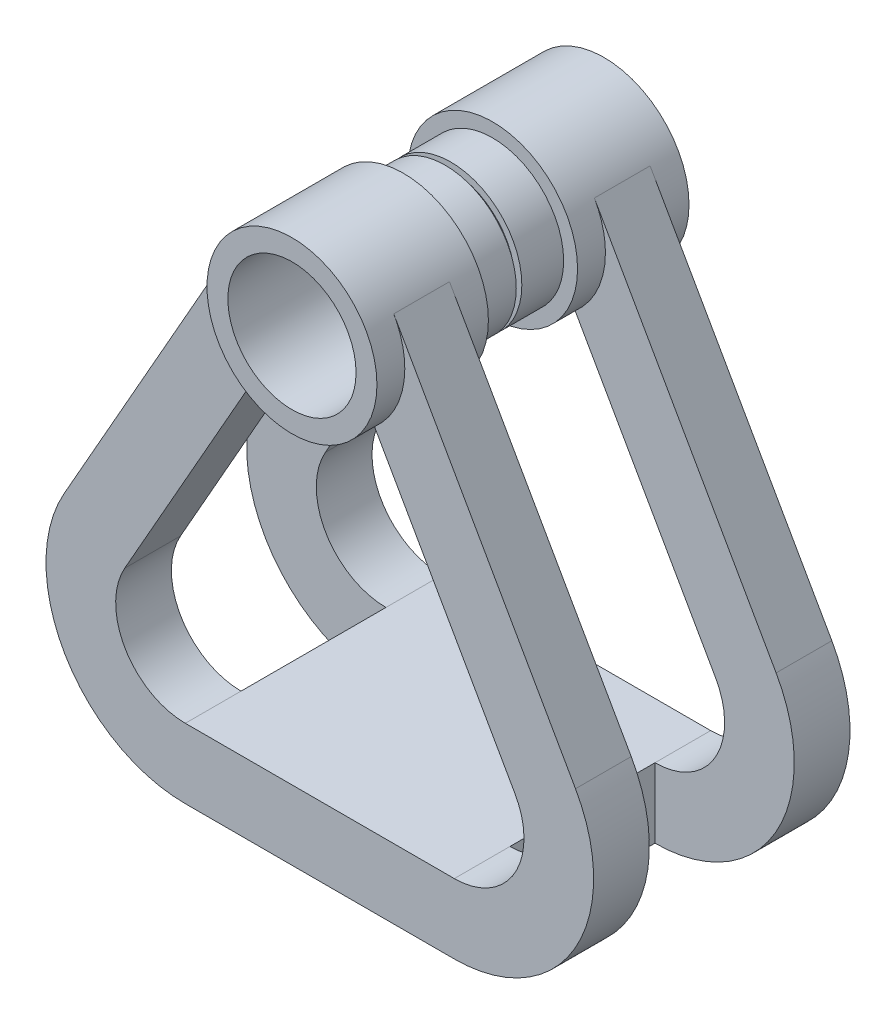
ISO-10303-21;
HEADER;
FILE_DESCRIPTION(('STEP AP214'),'2;1');
FILE_NAME('part.step','',(''),(''),'','','');
FILE_SCHEMA(('AUTOMOTIVE_DESIGN { 1 0 10303 214 1 1 1 1 }'));
ENDSEC;
DATA;
#1=APPLICATION_CONTEXT('core data for automotive mechanical design processes');
#2=APPLICATION_PROTOCOL_DEFINITION('international standard','automotive_design',2000,#1);
#3=PRODUCT_CONTEXT('',#1,'mechanical');
#4=PRODUCT('Part','Part','',(#3));
#5=PRODUCT_RELATED_PRODUCT_CATEGORY('part','',(#4));
#6=PRODUCT_DEFINITION_FORMATION('','',#4);
#7=PRODUCT_DEFINITION_CONTEXT('part definition',#1,'design');
#8=PRODUCT_DEFINITION('design','',#6,#7);
#9=PRODUCT_DEFINITION_SHAPE('','',#8);
#10=(LENGTH_UNIT() NAMED_UNIT(*) SI_UNIT(.MILLI.,.METRE.));
#11=(NAMED_UNIT(*) PLANE_ANGLE_UNIT() SI_UNIT($,.RADIAN.));
#12=(NAMED_UNIT(*) SI_UNIT($,.STERADIAN.) SOLID_ANGLE_UNIT());
#13=UNCERTAINTY_MEASURE_WITH_UNIT(LENGTH_MEASURE(1.E-05),#10,'distance_accuracy_value','');
#14=(GEOMETRIC_REPRESENTATION_CONTEXT(3) GLOBAL_UNCERTAINTY_ASSIGNED_CONTEXT((#13)) GLOBAL_UNIT_ASSIGNED_CONTEXT((#10,
#11,#12)) REPRESENTATION_CONTEXT('',''));
#15=CARTESIAN_POINT('',(0.,0.,0.));
#16=DIRECTION('',(0.,0.,1.));
#17=DIRECTION('',(1.,0.,0.));
#18=AXIS2_PLACEMENT_3D('',#15,#16,#17);
#19=CARTESIAN_POINT('',(0.,0.,5.));
#20=DIRECTION('',(0.,0.,1.));
#21=DIRECTION('',(1.,0.,0.));
#22=AXIS2_PLACEMENT_3D('',#19,#20,#21);
#23=PLANE('',#22);
#24=CARTESIAN_POINT('',(-9.65419329446629,-24.9202550824152,5.));
#25=DIRECTION('',(0.,0.,-1.));
#26=DIRECTION('',(1.,0.,0.));
#27=AXIS2_PLACEMENT_3D('',#24,#25,#26);
#28=CIRCLE('',#27,5.);
#29=CARTESIAN_POINT('',(-9.65419329446615,-29.9202550824152,5.));
#30=VERTEX_POINT('',#29);
#31=CARTESIAN_POINT('',(-14.0030577685067,-22.4529938910476,5.));
#32=VERTEX_POINT('',#31);
#33=EDGE_CURVE('E400',#30,#32,#28,.T.);
#34=ORIENTED_EDGE('',*,*,#33,.F.);
#35=DIRECTION('',(0.,1.,0.));
#36=VECTOR('',#35,1.);
#37=CARTESIAN_POINT('',(-9.65419329446615,-29.9202550824152,5.));
#38=LINE('',#37,#36);
#39=CARTESIAN_POINT('',(-9.65419329446615,-34.9202550824152,5.));
#40=VERTEX_POINT('',#39);
#41=EDGE_CURVE('E219',#40,#30,#38,.T.);
#42=ORIENTED_EDGE('',*,*,#41,.F.);
#43=CARTESIAN_POINT('',(-9.65419329446629,-24.9202550824152,5.));
#44=DIRECTION('',(0.,0.,1.));
#45=DIRECTION('',(1.,0.,0.));
#46=AXIS2_PLACEMENT_3D('',#43,#44,#45);
#47=CIRCLE('',#46,10.);
#48=CARTESIAN_POINT('',(-18.3519222425472,-19.9857326996799,5.));
#49=VERTEX_POINT('',#48);
#50=EDGE_CURVE('E414',#49,#40,#47,.T.);
#51=ORIENTED_EDGE('',*,*,#50,.F.);
#52=DIRECTION('',(-0.49345223827352,-0.869772894808095,0.));
#53=VECTOR('',#52,1.);
#54=CARTESIAN_POINT('',(-5.30561465832938,3.01005865346847,5.));
#55=LINE('',#54,#53);
#56=CARTESIAN_POINT('',(-5.30561465832938,3.01005865346847,5.));
#57=VERTEX_POINT('',#56);
#58=EDGE_CURVE('E410',#57,#49,#55,.T.);
#59=ORIENTED_EDGE('',*,*,#58,.F.);
#60=CARTESIAN_POINT('',(0.,0.,5.));
#61=DIRECTION('',(0.,0.,-1.));
#62=DIRECTION('',(1.,0.,0.));
#63=AXIS2_PLACEMENT_3D('',#60,#61,#62);
#64=CIRCLE('',#63,6.1);
#65=CARTESIAN_POINT('',(-3.91746361393002,-4.6758399067477,5.));
#66=VERTEX_POINT('',#65);
#67=EDGE_CURVE('E63',#66,#57,#64,.T.);
#68=ORIENTED_EDGE('',*,*,#67,.F.);
#69=DIRECTION('',(0.49345223827352,0.869772894808095,0.));
#70=VECTOR('',#69,1.);
#71=CARTESIAN_POINT('',(-3.91746361393002,-4.6758399067477,5.));
#72=LINE('',#71,#70);
#73=EDGE_CURVE('E404',#32,#66,#72,.T.);
#74=ORIENTED_EDGE('',*,*,#73,.F.);
#75=EDGE_LOOP('',(#34,#42,#51,#59,#68,#74));
#76=FACE_BOUND('',#75,.T.);
#77=ADVANCED_FACE('F47',(#76),#23,.F.);
#78=CARTESIAN_POINT('',(0.,0.,3.));
#79=DIRECTION('',(0.,0.,1.));
#80=DIRECTION('',(1.,0.,0.));
#81=AXIS2_PLACEMENT_3D('',#78,#79,#80);
#82=CYLINDRICAL_SURFACE('',#81,6.1);
#83=CARTESIAN_POINT('',(0.,0.,3.));
#84=DIRECTION('',(0.,0.,1.));
#85=DIRECTION('',(1.,0.,0.));
#86=AXIS2_PLACEMENT_3D('',#83,#84,#85);
#87=CIRCLE('',#86,6.1);
#88=CARTESIAN_POINT('',(6.1,0.,3.));
#89=VERTEX_POINT('',#88);
#90=EDGE_CURVE('E461',#89,#89,#87,.T.);
#91=ORIENTED_EDGE('',*,*,#90,.T.);
#92=EDGE_LOOP('',(#91));
#93=FACE_BOUND('',#92,.T.);
#94=CARTESIAN_POINT('',(0.,0.,11.));
#95=DIRECTION('',(0.,0.,1.));
#96=DIRECTION('',(1.,0.,0.));
#97=AXIS2_PLACEMENT_3D('',#94,#95,#96);
#98=CIRCLE('',#97,6.1);
#99=CARTESIAN_POINT('',(6.1,0.,11.));
#100=VERTEX_POINT('',#99);
#101=EDGE_CURVE('E430',#100,#100,#98,.T.);
#102=ORIENTED_EDGE('',*,*,#101,.F.);
#103=EDGE_LOOP('',(#102));
#104=FACE_BOUND('',#103,.T.);
#105=DIRECTION('',(0.,0.,1.));
#106=VECTOR('',#105,1.);
#107=CARTESIAN_POINT('',(5.30561465832938,3.01005865346847,5.));
#108=LINE('',#107,#106);
#109=CARTESIAN_POINT('',(5.30561465832938,3.01005865346847,5.));
#110=VERTEX_POINT('',#109);
#111=CARTESIAN_POINT('',(5.30561465832938,3.01005865346847,9.));
#112=VERTEX_POINT('',#111);
#113=EDGE_CURVE('E426',#110,#112,#108,.T.);
#114=ORIENTED_EDGE('',*,*,#113,.F.);
#115=CARTESIAN_POINT('',(0.,0.,5.));
#116=DIRECTION('',(0.,0.,-1.));
#117=DIRECTION('',(1.,0.,0.));
#118=AXIS2_PLACEMENT_3D('',#115,#116,#117);
#119=CIRCLE('',#118,6.1);
#120=CARTESIAN_POINT('',(3.91746361393003,-4.6758399067477,5.));
#121=VERTEX_POINT('',#120);
#122=EDGE_CURVE('E389',#110,#121,#119,.T.);
#123=ORIENTED_EDGE('',*,*,#122,.T.);
#124=DIRECTION('',(0.,0.,1.));
#125=VECTOR('',#124,1.);
#126=CARTESIAN_POINT('',(3.91746361393003,-4.6758399067477,5.));
#127=LINE('',#126,#125);
#128=CARTESIAN_POINT('',(3.91746361393003,-4.6758399067477,9.));
#129=VERTEX_POINT('',#128);
#130=EDGE_CURVE('E425',#121,#129,#127,.T.);
#131=ORIENTED_EDGE('',*,*,#130,.T.);
#132=CARTESIAN_POINT('',(0.,0.,9.));
#133=DIRECTION('',(0.,0.,-1.));
#134=DIRECTION('',(1.,0.,0.));
#135=AXIS2_PLACEMENT_3D('',#132,#133,#134);
#136=CIRCLE('',#135,6.1);
#137=EDGE_CURVE('E341',#112,#129,#136,.T.);
#138=ORIENTED_EDGE('',*,*,#137,.F.);
#139=EDGE_LOOP('',(#114,#123,#131,#138));
#140=FACE_BOUND('',#139,.T.);
#141=DIRECTION('',(0.,0.,1.));
#142=VECTOR('',#141,1.);
#143=CARTESIAN_POINT('',(-3.91746361393003,-4.6758399067477,5.));
#144=LINE('',#143,#142);
#145=CARTESIAN_POINT('',(-3.91746361393002,-4.6758399067477,9.));
#146=VERTEX_POINT('',#145);
#147=EDGE_CURVE('E68',#66,#146,#144,.T.);
#148=ORIENTED_EDGE('',*,*,#147,.F.);
#149=ORIENTED_EDGE('',*,*,#67,.T.);
#150=DIRECTION('',(0.,0.,1.));
#151=VECTOR('',#150,1.);
#152=CARTESIAN_POINT('',(-5.30561465832938,3.01005865346847,5.));
#153=LINE('',#152,#151);
#154=CARTESIAN_POINT('',(-5.30561465832938,3.01005865346847,9.));
#155=VERTEX_POINT('',#154);
#156=EDGE_CURVE('E442',#57,#155,#153,.T.);
#157=ORIENTED_EDGE('',*,*,#156,.T.);
#158=CARTESIAN_POINT('',(0.,0.,9.));
#159=DIRECTION('',(0.,0.,-1.));
#160=DIRECTION('',(1.,0.,0.));
#161=AXIS2_PLACEMENT_3D('',#158,#159,#160);
#162=CIRCLE('',#161,6.1);
#163=EDGE_CURVE('E365',#146,#155,#162,.T.);
#164=ORIENTED_EDGE('',*,*,#163,.F.);
#165=EDGE_LOOP('',(#148,#149,#157,#164));
#166=FACE_BOUND('',#165,.T.);
#167=ADVANCED_FACE('F501',(#93,#104,#140,#166),#82,.T.);
#168=CARTESIAN_POINT('',(0.,0.,11.));
#169=DIRECTION('',(0.,0.,-1.));
#170=DIRECTION('',(-1.,0.,0.));
#171=AXIS2_PLACEMENT_3D('',#168,#169,#170);
#172=CYLINDRICAL_SURFACE('',#171,5.1);
#173=CARTESIAN_POINT('',(0.,0.,0.));
#174=DIRECTION('',(0.,0.,1.));
#175=DIRECTION('',(1.,0.,0.));
#176=AXIS2_PLACEMENT_3D('',#173,#174,#175);
#177=CIRCLE('',#176,5.1);
#178=CARTESIAN_POINT('',(5.1,0.,0.));
#179=VERTEX_POINT('',#178);
#180=EDGE_CURVE('E56',#179,#179,#177,.T.);
#181=ORIENTED_EDGE('',*,*,#180,.T.);
#182=EDGE_LOOP('',(#181));
#183=FACE_BOUND('',#182,.T.);
#184=CARTESIAN_POINT('',(0.,0.,3.));
#185=DIRECTION('',(0.,0.,1.));
#186=DIRECTION('',(1.,0.,0.));
#187=AXIS2_PLACEMENT_3D('',#184,#185,#186);
#188=CIRCLE('',#187,5.1);
#189=CARTESIAN_POINT('',(5.1,0.,3.));
#190=VERTEX_POINT('',#189);
#191=EDGE_CURVE('E12',#190,#190,#188,.T.);
#192=ORIENTED_EDGE('',*,*,#191,.F.);
#193=EDGE_LOOP('',(#192));
#194=FACE_BOUND('',#193,.T.);
#195=ADVANCED_FACE('F49',(#183,#194),#172,.T.);
#196=CARTESIAN_POINT('',(0.,0.,11.));
#197=DIRECTION('',(0.,0.,1.));
#198=DIRECTION('',(1.,0.,0.));
#199=AXIS2_PLACEMENT_3D('',#196,#197,#198);
#200=PLANE('',#199);
#201=CARTESIAN_POINT('',(0.,0.,11.));
#202=DIRECTION('',(0.,0.,1.));
#203=DIRECTION('',(1.,0.,0.));
#204=AXIS2_PLACEMENT_3D('',#201,#202,#203);
#205=CIRCLE('',#204,4.6);
#206=CARTESIAN_POINT('',(4.6,0.,11.));
#207=VERTEX_POINT('',#206);
#208=EDGE_CURVE('E469',#207,#207,#205,.T.);
#209=ORIENTED_EDGE('',*,*,#208,.F.);
#210=EDGE_LOOP('',(#209));
#211=FACE_BOUND('',#210,.T.);
#212=ORIENTED_EDGE('',*,*,#101,.T.);
#213=EDGE_LOOP('',(#212));
#214=FACE_BOUND('',#213,.T.);
#215=ADVANCED_FACE('F485',(#211,#214),#200,.T.);
#216=CARTESIAN_POINT('',(0.,0.,0.));
#217=DIRECTION('',(0.,0.,1.));
#218=DIRECTION('',(1.,0.,0.));
#219=AXIS2_PLACEMENT_3D('',#216,#217,#218);
#220=PLANE('',#219);
#221=ORIENTED_EDGE('',*,*,#180,.F.);
#222=EDGE_LOOP('',(#221));
#223=FACE_BOUND('',#222,.T.);
#224=CARTESIAN_POINT('',(0.,0.,0.));
#225=DIRECTION('',(0.,0.,1.));
#226=DIRECTION('',(1.,0.,0.));
#227=AXIS2_PLACEMENT_3D('',#224,#225,#226);
#228=CIRCLE('',#227,4.6);
#229=CARTESIAN_POINT('',(4.6,0.,0.));
#230=VERTEX_POINT('',#229);
#231=EDGE_CURVE('E465',#230,#230,#228,.T.);
#232=ORIENTED_EDGE('',*,*,#231,.T.);
#233=EDGE_LOOP('',(#232));
#234=FACE_BOUND('',#233,.T.);
#235=ADVANCED_FACE('F481',(#223,#234),#220,.F.);
#236=CARTESIAN_POINT('',(0.,0.,11.));
#237=DIRECTION('',(0.,0.,-1.));
#238=DIRECTION('',(-1.,0.,0.));
#239=AXIS2_PLACEMENT_3D('',#236,#237,#238);
#240=CYLINDRICAL_SURFACE('',#239,4.6);
#241=ORIENTED_EDGE('',*,*,#208,.T.);
#242=EDGE_LOOP('',(#241));
#243=FACE_BOUND('',#242,.T.);
#244=ORIENTED_EDGE('',*,*,#231,.F.);
#245=EDGE_LOOP('',(#244));
#246=FACE_BOUND('',#245,.T.);
#247=ADVANCED_FACE('F484',(#243,#246),#240,.F.);
#248=CARTESIAN_POINT('',(0.,0.,3.));
#249=DIRECTION('',(0.,0.,1.));
#250=DIRECTION('',(1.,0.,0.));
#251=AXIS2_PLACEMENT_3D('',#248,#249,#250);
#252=PLANE('',#251);
#253=ORIENTED_EDGE('',*,*,#191,.T.);
#254=EDGE_LOOP('',(#253));
#255=FACE_BOUND('',#254,.T.);
#256=ORIENTED_EDGE('',*,*,#90,.F.);
#257=EDGE_LOOP('',(#256));
#258=FACE_BOUND('',#257,.T.);
#259=ADVANCED_FACE('F489',(#255,#258),#252,.F.);
#260=CARTESIAN_POINT('',(5.30561465832938,3.01005865346847,5.));
#261=DIRECTION('',(0.869772894808095,0.49345223827352,0.));
#262=DIRECTION('',(-0.49345223827352,0.869772894808095,0.));
#263=AXIS2_PLACEMENT_3D('',#260,#261,#262);
#264=PLANE('',#263);
#265=ORIENTED_EDGE('',*,*,#113,.T.);
#266=DIRECTION('',(-0.49345223827352,0.869772894808095,0.));
#267=VECTOR('',#266,1.);
#268=CARTESIAN_POINT('',(5.30561465832938,3.01005865346847,9.));
#269=LINE('',#268,#267);
#270=CARTESIAN_POINT('',(18.3519222425472,-19.9857326996799,9.));
#271=VERTEX_POINT('',#270);
#272=EDGE_CURVE('E385',#271,#112,#269,.T.);
#273=ORIENTED_EDGE('',*,*,#272,.F.);
#274=DIRECTION('',(0.,0.,1.));
#275=VECTOR('',#274,1.);
#276=CARTESIAN_POINT('',(18.3519222425472,-19.9857326996799,5.));
#277=LINE('',#276,#275);
#278=CARTESIAN_POINT('',(18.3519222425472,-19.9857326996799,5.));
#279=VERTEX_POINT('',#278);
#280=EDGE_CURVE('E431',#279,#271,#277,.T.);
#281=ORIENTED_EDGE('',*,*,#280,.F.);
#282=DIRECTION('',(-0.49345223827352,0.869772894808095,0.));
#283=VECTOR('',#282,1.);
#284=CARTESIAN_POINT('',(5.30561465832938,3.01005865346847,5.));
#285=LINE('',#284,#283);
#286=EDGE_CURVE('E421',#279,#110,#285,.T.);
#287=ORIENTED_EDGE('',*,*,#286,.T.);
#288=EDGE_LOOP('',(#265,#273,#281,#287));
#289=FACE_BOUND('',#288,.T.);
#290=ADVANCED_FACE('F495',(#289),#264,.T.);
#291=CARTESIAN_POINT('',(9.6541932944663,-24.9202550824152,5.));
#292=DIRECTION('',(0.,0.,1.));
#293=DIRECTION('',(1.,0.,0.));
#294=AXIS2_PLACEMENT_3D('',#291,#292,#293);
#295=CYLINDRICAL_SURFACE('',#294,10.);
#296=ORIENTED_EDGE('',*,*,#280,.T.);
#297=CARTESIAN_POINT('',(9.6541932944663,-24.9202550824152,9.));
#298=DIRECTION('',(0.,0.,1.));
#299=DIRECTION('',(-1.,0.,0.));
#300=AXIS2_PLACEMENT_3D('',#297,#298,#299);
#301=CIRCLE('',#300,10.);
#302=CARTESIAN_POINT('',(9.65419329446616,-34.9202550824152,9.));
#303=VERTEX_POINT('',#302);
#304=EDGE_CURVE('E381',#303,#271,#301,.T.);
#305=ORIENTED_EDGE('',*,*,#304,.F.);
#306=DIRECTION('',(0.,0.,1.));
#307=VECTOR('',#306,1.);
#308=CARTESIAN_POINT('',(9.65419329446616,-34.9202550824152,5.));
#309=LINE('',#308,#307);
#310=CARTESIAN_POINT('',(9.65419329446623,-34.9202550824152,5.));
#311=VERTEX_POINT('',#310);
#312=EDGE_CURVE('E434',#311,#303,#309,.T.);
#313=ORIENTED_EDGE('',*,*,#312,.F.);
#314=CARTESIAN_POINT('',(9.6541932944663,-24.9202550824152,5.));
#315=DIRECTION('',(0.,0.,1.));
#316=DIRECTION('',(-1.,0.,0.));
#317=AXIS2_PLACEMENT_3D('',#314,#315,#316);
#318=CIRCLE('',#317,10.);
#319=EDGE_CURVE('E417',#311,#279,#318,.T.);
#320=ORIENTED_EDGE('',*,*,#319,.T.);
#321=EDGE_LOOP('',(#296,#305,#313,#320));
#322=FACE_BOUND('',#321,.T.);
#323=ADVANCED_FACE('F532',(#322),#295,.T.);
#324=CARTESIAN_POINT('',(9.65419329446616,-34.9202550824152,5.));
#325=DIRECTION('',(0.,-1.,0.));
#326=DIRECTION('',(0.,0.,-1.));
#327=AXIS2_PLACEMENT_3D('',#324,#325,#326);
#328=PLANE('',#327);
#329=ORIENTED_EDGE('',*,*,#312,.T.);
#330=DIRECTION('',(1.,0.,0.));
#331=VECTOR('',#330,1.);
#332=CARTESIAN_POINT('',(9.65419329446616,-34.9202550824152,9.));
#333=LINE('',#332,#331);
#334=CARTESIAN_POINT('',(-9.65419329446615,-34.9202550824152,9.));
#335=VERTEX_POINT('',#334);
#336=EDGE_CURVE('E377',#335,#303,#333,.T.);
#337=ORIENTED_EDGE('',*,*,#336,.F.);
#338=DIRECTION('',(0.,0.,1.));
#339=VECTOR('',#338,1.);
#340=CARTESIAN_POINT('',(-9.65419329446615,-34.9202550824152,5.));
#341=LINE('',#340,#339);
#342=EDGE_CURVE('E212',#40,#335,#341,.T.);
#343=ORIENTED_EDGE('',*,*,#342,.F.);
#344=DIRECTION('',(0.,0.,-1.));
#345=VECTOR('',#344,1.);
#346=CARTESIAN_POINT('',(-9.65419329446615,-34.9202550824152,24.9452699321835));
#347=LINE('',#346,#345);
#348=CARTESIAN_POINT('',(-9.65419329446615,-34.9202550824152,-5.4));
#349=VERTEX_POINT('',#348);
#350=EDGE_CURVE('E207',#40,#349,#347,.T.);
#351=ORIENTED_EDGE('',*,*,#350,.T.);
#352=DIRECTION('',(0.,0.,-1.));
#353=VECTOR('',#352,1.);
#354=CARTESIAN_POINT('',(-9.65419329446615,-34.9202550824152,-5.4));
#355=LINE('',#354,#353);
#356=CARTESIAN_POINT('',(-9.65419329446615,-34.9202550824152,-9.4));
#357=VERTEX_POINT('',#356);
#358=EDGE_CURVE('E210',#349,#357,#355,.T.);
#359=ORIENTED_EDGE('',*,*,#358,.T.);
#360=DIRECTION('',(1.,0.,0.));
#361=VECTOR('',#360,1.);
#362=CARTESIAN_POINT('',(9.65419329446616,-34.9202550824152,-9.4));
#363=LINE('',#362,#361);
#364=CARTESIAN_POINT('',(9.65419329446616,-34.9202550824152,-9.4));
#365=VERTEX_POINT('',#364);
#366=EDGE_CURVE('E611',#357,#365,#363,.T.);
#367=ORIENTED_EDGE('',*,*,#366,.T.);
#368=DIRECTION('',(0.,0.,-1.));
#369=VECTOR('',#368,1.);
#370=CARTESIAN_POINT('',(9.65419329446616,-34.9202550824152,-5.4));
#371=LINE('',#370,#369);
#372=CARTESIAN_POINT('',(9.65419329446623,-34.9202550824152,-5.4));
#373=VERTEX_POINT('',#372);
#374=EDGE_CURVE('E233',#373,#365,#371,.T.);
#375=ORIENTED_EDGE('',*,*,#374,.F.);
#376=DIRECTION('',(0.,0.,-1.));
#377=VECTOR('',#376,1.);
#378=CARTESIAN_POINT('',(9.65419329446623,-34.9202550824152,24.9452699321835));
#379=LINE('',#378,#377);
#380=EDGE_CURVE('E331',#311,#373,#379,.T.);
#381=ORIENTED_EDGE('',*,*,#380,.F.);
#382=EDGE_LOOP('',(#329,#337,#343,#351,#359,#367,#375,#381));
#383=FACE_BOUND('',#382,.T.);
#384=ADVANCED_FACE('F209',(#383),#328,.T.);
#385=CARTESIAN_POINT('',(-9.65419329446629,-24.9202550824152,5.));
#386=DIRECTION('',(0.,0.,1.));
#387=DIRECTION('',(1.,0.,0.));
#388=AXIS2_PLACEMENT_3D('',#385,#386,#387);
#389=CYLINDRICAL_SURFACE('',#388,10.);
#390=ORIENTED_EDGE('',*,*,#342,.T.);
#391=CARTESIAN_POINT('',(-9.65419329446629,-24.9202550824152,9.));
#392=DIRECTION('',(0.,0.,1.));
#393=DIRECTION('',(1.,0.,0.));
#394=AXIS2_PLACEMENT_3D('',#391,#392,#393);
#395=CIRCLE('',#394,10.);
#396=CARTESIAN_POINT('',(-18.3519222425472,-19.9857326996799,9.));
#397=VERTEX_POINT('',#396);
#398=EDGE_CURVE('E373',#397,#335,#395,.T.);
#399=ORIENTED_EDGE('',*,*,#398,.F.);
#400=DIRECTION('',(0.,0.,1.));
#401=VECTOR('',#400,1.);
#402=CARTESIAN_POINT('',(-18.3519222425472,-19.9857326996799,5.));
#403=LINE('',#402,#401);
#404=EDGE_CURVE('E439',#49,#397,#403,.T.);
#405=ORIENTED_EDGE('',*,*,#404,.F.);
#406=ORIENTED_EDGE('',*,*,#50,.T.);
#407=EDGE_LOOP('',(#390,#399,#405,#406));
#408=FACE_BOUND('',#407,.T.);
#409=ADVANCED_FACE('F540',(#408),#389,.T.);
#410=CARTESIAN_POINT('',(-5.30561465832938,3.01005865346847,5.));
#411=DIRECTION('',(-0.869772894808095,0.49345223827352,0.));
#412=DIRECTION('',(-0.49345223827352,-0.869772894808095,0.));
#413=AXIS2_PLACEMENT_3D('',#410,#411,#412);
#414=PLANE('',#413);
#415=ORIENTED_EDGE('',*,*,#404,.T.);
#416=DIRECTION('',(-0.49345223827352,-0.869772894808095,0.));
#417=VECTOR('',#416,1.);
#418=CARTESIAN_POINT('',(-5.30561465832938,3.01005865346847,9.));
#419=LINE('',#418,#417);
#420=EDGE_CURVE('E369',#155,#397,#419,.T.);
#421=ORIENTED_EDGE('',*,*,#420,.F.);
#422=ORIENTED_EDGE('',*,*,#156,.F.);
#423=ORIENTED_EDGE('',*,*,#58,.T.);
#424=EDGE_LOOP('',(#415,#421,#422,#423));
#425=FACE_BOUND('',#424,.T.);
#426=ADVANCED_FACE('F544',(#425),#414,.T.);
#427=CARTESIAN_POINT('',(-3.91746361393002,-4.6758399067477,5.));
#428=DIRECTION('',(0.869772894808095,-0.49345223827352,0.));
#429=DIRECTION('',(0.49345223827352,0.869772894808095,0.));
#430=AXIS2_PLACEMENT_3D('',#427,#428,#429);
#431=PLANE('',#430);
#432=ORIENTED_EDGE('',*,*,#147,.T.);
#433=DIRECTION('',(0.49345223827352,0.869772894808095,0.));
#434=VECTOR('',#433,1.);
#435=CARTESIAN_POINT('',(-3.91746361393002,-4.6758399067477,9.));
#436=LINE('',#435,#434);
#437=CARTESIAN_POINT('',(-14.0030577685067,-22.4529938910476,9.));
#438=VERTEX_POINT('',#437);
#439=EDGE_CURVE('E361',#438,#146,#436,.T.);
#440=ORIENTED_EDGE('',*,*,#439,.F.);
#441=DIRECTION('',(0.,0.,1.));
#442=VECTOR('',#441,1.);
#443=CARTESIAN_POINT('',(-14.0030577685067,-22.4529938910476,5.));
#444=LINE('',#443,#442);
#445=EDGE_CURVE('E447',#32,#438,#444,.T.);
#446=ORIENTED_EDGE('',*,*,#445,.F.);
#447=ORIENTED_EDGE('',*,*,#73,.T.);
#448=EDGE_LOOP('',(#432,#440,#446,#447));
#449=FACE_BOUND('',#448,.T.);
#450=ADVANCED_FACE('F548',(#449),#431,.T.);
#451=CARTESIAN_POINT('',(-9.65419329446629,-24.9202550824152,5.));
#452=DIRECTION('',(0.,0.,1.));
#453=DIRECTION('',(1.,0.,0.));
#454=AXIS2_PLACEMENT_3D('',#451,#452,#453);
#455=CYLINDRICAL_SURFACE('',#454,5.);
#456=ORIENTED_EDGE('',*,*,#445,.T.);
#457=CARTESIAN_POINT('',(-9.65419329446629,-24.9202550824152,9.));
#458=DIRECTION('',(0.,0.,-1.));
#459=DIRECTION('',(1.,0.,0.));
#460=AXIS2_PLACEMENT_3D('',#457,#458,#459);
#461=CIRCLE('',#460,5.);
#462=CARTESIAN_POINT('',(-9.65419329446615,-29.9202550824152,9.));
#463=VERTEX_POINT('',#462);
#464=EDGE_CURVE('E357',#463,#438,#461,.T.);
#465=ORIENTED_EDGE('',*,*,#464,.F.);
#466=DIRECTION('',(0.,0.,1.));
#467=VECTOR('',#466,1.);
#468=CARTESIAN_POINT('',(-9.65419329446615,-29.9202550824152,5.));
#469=LINE('',#468,#467);
#470=EDGE_CURVE('E450',#30,#463,#469,.T.);
#471=ORIENTED_EDGE('',*,*,#470,.F.);
#472=ORIENTED_EDGE('',*,*,#33,.T.);
#473=EDGE_LOOP('',(#456,#465,#471,#472));
#474=FACE_BOUND('',#473,.T.);
#475=ADVANCED_FACE('F552',(#474),#455,.F.);
#476=CARTESIAN_POINT('',(9.65419329446623,-29.9202550824152,5.));
#477=DIRECTION('',(0.,1.,0.));
#478=DIRECTION('',(0.,0.,1.));
#479=AXIS2_PLACEMENT_3D('',#476,#477,#478);
#480=PLANE('',#479);
#481=ORIENTED_EDGE('',*,*,#470,.T.);
#482=DIRECTION('',(-1.,0.,0.));
#483=VECTOR('',#482,1.);
#484=CARTESIAN_POINT('',(9.65419329446623,-29.9202550824152,9.));
#485=LINE('',#484,#483);
#486=CARTESIAN_POINT('',(9.65419329446623,-29.9202550824152,9.));
#487=VERTEX_POINT('',#486);
#488=EDGE_CURVE('E353',#487,#463,#485,.T.);
#489=ORIENTED_EDGE('',*,*,#488,.F.);
#490=DIRECTION('',(0.,0.,1.));
#491=VECTOR('',#490,1.);
#492=CARTESIAN_POINT('',(9.65419329446623,-29.9202550824152,5.));
#493=LINE('',#492,#491);
#494=CARTESIAN_POINT('',(9.65419329446623,-29.9202550824152,5.));
#495=VERTEX_POINT('',#494);
#496=EDGE_CURVE('E453',#495,#487,#493,.T.);
#497=ORIENTED_EDGE('',*,*,#496,.F.);
#498=DIRECTION('',(0.,0.,-1.));
#499=VECTOR('',#498,1.);
#500=CARTESIAN_POINT('',(9.65419329446623,-29.9202550824152,24.9452699321835));
#501=LINE('',#500,#499);
#502=CARTESIAN_POINT('',(9.65419329446623,-29.9202550824152,-5.4));
#503=VERTEX_POINT('',#502);
#504=EDGE_CURVE('E332',#495,#503,#501,.T.);
#505=ORIENTED_EDGE('',*,*,#504,.T.);
#506=DIRECTION('',(0.,0.,-1.));
#507=VECTOR('',#506,1.);
#508=CARTESIAN_POINT('',(9.65419329446623,-29.9202550824152,-5.4));
#509=LINE('',#508,#507);
#510=CARTESIAN_POINT('',(9.65419329446623,-29.9202550824152,-9.4));
#511=VERTEX_POINT('',#510);
#512=EDGE_CURVE('E295',#503,#511,#509,.T.);
#513=ORIENTED_EDGE('',*,*,#512,.T.);
#514=DIRECTION('',(-1.,0.,0.));
#515=VECTOR('',#514,1.);
#516=CARTESIAN_POINT('',(9.65419329446623,-29.9202550824152,-9.4));
#517=LINE('',#516,#515);
#518=CARTESIAN_POINT('',(-9.65419329446615,-29.9202550824152,-9.4));
#519=VERTEX_POINT('',#518);
#520=EDGE_CURVE('E585',#511,#519,#517,.T.);
#521=ORIENTED_EDGE('',*,*,#520,.T.);
#522=DIRECTION('',(0.,0.,-1.));
#523=VECTOR('',#522,1.);
#524=CARTESIAN_POINT('',(-9.65419329446615,-29.9202550824152,-5.4));
#525=LINE('',#524,#523);
#526=CARTESIAN_POINT('',(-9.65419329446615,-29.9202550824152,-5.4));
#527=VERTEX_POINT('',#526);
#528=EDGE_CURVE('E291',#527,#519,#525,.T.);
#529=ORIENTED_EDGE('',*,*,#528,.F.);
#530=DIRECTION('',(0.,0.,-1.));
#531=VECTOR('',#530,1.);
#532=CARTESIAN_POINT('',(-9.65419329446615,-29.9202550824152,24.9452699321835));
#533=LINE('',#532,#531);
#534=EDGE_CURVE('E239',#30,#527,#533,.T.);
#535=ORIENTED_EDGE('',*,*,#534,.F.);
#536=EDGE_LOOP('',(#481,#489,#497,#505,#513,#521,#529,#535));
#537=FACE_BOUND('',#536,.T.);
#538=ADVANCED_FACE('F555',(#537),#480,.T.);
#539=CARTESIAN_POINT('',(9.6541932944663,-24.9202550824152,5.));
#540=DIRECTION('',(0.,0.,1.));
#541=DIRECTION('',(1.,0.,0.));
#542=AXIS2_PLACEMENT_3D('',#539,#540,#541);
#543=CYLINDRICAL_SURFACE('',#542,5.);
#544=ORIENTED_EDGE('',*,*,#496,.T.);
#545=CARTESIAN_POINT('',(9.6541932944663,-24.9202550824152,9.));
#546=DIRECTION('',(0.,0.,-1.));
#547=DIRECTION('',(-1.,0.,0.));
#548=AXIS2_PLACEMENT_3D('',#545,#546,#547);
#549=CIRCLE('',#548,5.);
#550=CARTESIAN_POINT('',(14.0030577685067,-22.4529938910475,9.));
#551=VERTEX_POINT('',#550);
#552=EDGE_CURVE('E349',#551,#487,#549,.T.);
#553=ORIENTED_EDGE('',*,*,#552,.F.);
#554=DIRECTION('',(0.,0.,1.));
#555=VECTOR('',#554,1.);
#556=CARTESIAN_POINT('',(14.0030577685067,-22.4529938910475,5.));
#557=LINE('',#556,#555);
#558=CARTESIAN_POINT('',(14.0030577685067,-22.4529938910475,5.));
#559=VERTEX_POINT('',#558);
#560=EDGE_CURVE('E456',#559,#551,#557,.T.);
#561=ORIENTED_EDGE('',*,*,#560,.F.);
#562=CARTESIAN_POINT('',(9.6541932944663,-24.9202550824152,5.));
#563=DIRECTION('',(0.,0.,-1.));
#564=DIRECTION('',(-1.,0.,0.));
#565=AXIS2_PLACEMENT_3D('',#562,#563,#564);
#566=CIRCLE('',#565,5.);
#567=EDGE_CURVE('E396',#559,#495,#566,.T.);
#568=ORIENTED_EDGE('',*,*,#567,.T.);
#569=EDGE_LOOP('',(#544,#553,#561,#568));
#570=FACE_BOUND('',#569,.T.);
#571=ADVANCED_FACE('F521',(#570),#543,.F.);
#572=CARTESIAN_POINT('',(3.91746361393003,-4.6758399067477,5.));
#573=DIRECTION('',(-0.869772894808095,-0.49345223827352,0.));
#574=DIRECTION('',(0.49345223827352,-0.869772894808095,0.));
#575=AXIS2_PLACEMENT_3D('',#572,#573,#574);
#576=PLANE('',#575);
#577=ORIENTED_EDGE('',*,*,#560,.T.);
#578=DIRECTION('',(0.49345223827352,-0.869772894808095,0.));
#579=VECTOR('',#578,1.);
#580=CARTESIAN_POINT('',(3.91746361393003,-4.6758399067477,9.));
#581=LINE('',#580,#579);
#582=EDGE_CURVE('E345',#129,#551,#581,.T.);
#583=ORIENTED_EDGE('',*,*,#582,.F.);
#584=ORIENTED_EDGE('',*,*,#130,.F.);
#585=DIRECTION('',(0.49345223827352,-0.869772894808095,0.));
#586=VECTOR('',#585,1.);
#587=CARTESIAN_POINT('',(3.91746361393003,-4.6758399067477,5.));
#588=LINE('',#587,#586);
#589=EDGE_CURVE('E392',#121,#559,#588,.T.);
#590=ORIENTED_EDGE('',*,*,#589,.T.);
#591=EDGE_LOOP('',(#577,#583,#584,#590));
#592=FACE_BOUND('',#591,.T.);
#593=ADVANCED_FACE('F514',(#592),#576,.T.);
#594=ORIENTED_EDGE('',*,*,#319,.F.);
#595=DIRECTION('',(0.,-1.,0.));
#596=VECTOR('',#595,1.);
#597=CARTESIAN_POINT('',(9.65419329446623,-29.9202550824152,5.));
#598=LINE('',#597,#596);
#599=EDGE_CURVE('E328',#495,#311,#598,.T.);
#600=ORIENTED_EDGE('',*,*,#599,.F.);
#601=ORIENTED_EDGE('',*,*,#567,.F.);
#602=ORIENTED_EDGE('',*,*,#589,.F.);
#603=ORIENTED_EDGE('',*,*,#122,.F.);
#604=ORIENTED_EDGE('',*,*,#286,.F.);
#605=EDGE_LOOP('',(#594,#600,#601,#602,#603,#604));
#606=FACE_BOUND('',#605,.T.);
#607=ADVANCED_FACE('F504',(#606),#23,.F.);
#608=CARTESIAN_POINT('',(0.,0.,9.));
#609=DIRECTION('',(0.,0.,1.));
#610=DIRECTION('',(1.,0.,0.));
#611=AXIS2_PLACEMENT_3D('',#608,#609,#610);
#612=PLANE('',#611);
#613=ORIENTED_EDGE('',*,*,#137,.T.);
#614=ORIENTED_EDGE('',*,*,#582,.T.);
#615=ORIENTED_EDGE('',*,*,#552,.T.);
#616=ORIENTED_EDGE('',*,*,#488,.T.);
#617=ORIENTED_EDGE('',*,*,#464,.T.);
#618=ORIENTED_EDGE('',*,*,#439,.T.);
#619=ORIENTED_EDGE('',*,*,#163,.T.);
#620=ORIENTED_EDGE('',*,*,#420,.T.);
#621=ORIENTED_EDGE('',*,*,#398,.T.);
#622=ORIENTED_EDGE('',*,*,#336,.T.);
#623=ORIENTED_EDGE('',*,*,#304,.T.);
#624=ORIENTED_EDGE('',*,*,#272,.T.);
#625=EDGE_LOOP('',(#613,#614,#615,#616,#617,#618,#619,#620,#621,#622,#623,#624));
#626=FACE_BOUND('',#625,.T.);
#627=ADVANCED_FACE('F513',(#626),#612,.T.);
#628=CARTESIAN_POINT('',(-9.65419329446615,-29.9202550824152,24.9452699321835));
#629=DIRECTION('',(-1.,0.,0.));
#630=DIRECTION('',(0.,0.,1.));
#631=AXIS2_PLACEMENT_3D('',#628,#629,#630);
#632=PLANE('',#631);
#633=ORIENTED_EDGE('',*,*,#350,.F.);
#634=ORIENTED_EDGE('',*,*,#41,.T.);
#635=ORIENTED_EDGE('',*,*,#534,.T.);
#636=DIRECTION('',(0.,1.,0.));
#637=VECTOR('',#636,1.);
#638=CARTESIAN_POINT('',(-9.65419329446615,-29.9202550824152,-5.4));
#639=LINE('',#638,#637);
#640=EDGE_CURVE('E237',#349,#527,#639,.T.);
#641=ORIENTED_EDGE('',*,*,#640,.F.);
#642=EDGE_LOOP('',(#633,#634,#635,#641));
#643=FACE_BOUND('',#642,.T.);
#644=ADVANCED_FACE('F238',(#643),#632,.T.);
#645=CARTESIAN_POINT('',(9.65419329446623,-29.9202550824152,24.9452699321835));
#646=DIRECTION('',(1.,0.,0.));
#647=DIRECTION('',(0.,0.,-1.));
#648=AXIS2_PLACEMENT_3D('',#645,#646,#647);
#649=PLANE('',#648);
#650=ORIENTED_EDGE('',*,*,#504,.F.);
#651=ORIENTED_EDGE('',*,*,#599,.T.);
#652=ORIENTED_EDGE('',*,*,#380,.T.);
#653=DIRECTION('',(0.,-1.,0.));
#654=VECTOR('',#653,1.);
#655=CARTESIAN_POINT('',(9.65419329446623,-29.9202550824152,-5.4));
#656=LINE('',#655,#654);
#657=EDGE_CURVE('E245',#503,#373,#656,.T.);
#658=ORIENTED_EDGE('',*,*,#657,.F.);
#659=EDGE_LOOP('',(#650,#651,#652,#658));
#660=FACE_BOUND('',#659,.T.);
#661=ADVANCED_FACE('F564',(#660),#649,.T.);
#662=CARTESIAN_POINT('',(0.,0.,-5.4));
#663=DIRECTION('',(0.,0.,-1.));
#664=DIRECTION('',(1.,0.,0.));
#665=AXIS2_PLACEMENT_3D('',#662,#663,#664);
#666=PLANE('',#665);
#667=CARTESIAN_POINT('',(-9.65419329446629,-24.9202550824152,-5.4));
#668=DIRECTION('',(0.,0.,-1.));
#669=DIRECTION('',(1.,0.,0.));
#670=AXIS2_PLACEMENT_3D('',#667,#668,#669);
#671=CIRCLE('',#670,5.);
#672=CARTESIAN_POINT('',(-14.0030577685067,-22.4529938910476,-5.4));
#673=VERTEX_POINT('',#672);
#674=EDGE_CURVE('E577',#527,#673,#671,.T.);
#675=ORIENTED_EDGE('',*,*,#674,.T.);
#676=DIRECTION('',(0.49345223827352,0.869772894808095,0.));
#677=VECTOR('',#676,1.);
#678=CARTESIAN_POINT('',(-3.91746361393002,-4.6758399067477,-5.4));
#679=LINE('',#678,#677);
#680=CARTESIAN_POINT('',(-3.91746361393002,-4.6758399067477,-5.4));
#681=VERTEX_POINT('',#680);
#682=EDGE_CURVE('E627',#673,#681,#679,.T.);
#683=ORIENTED_EDGE('',*,*,#682,.T.);
#684=CARTESIAN_POINT('',(0.,0.,-5.4));
#685=DIRECTION('',(0.,0.,-1.));
#686=DIRECTION('',(1.,0.,0.));
#687=AXIS2_PLACEMENT_3D('',#684,#685,#686);
#688=CIRCLE('',#687,6.1);
#689=CARTESIAN_POINT('',(-5.30561465832938,3.01005865346847,-5.4));
#690=VERTEX_POINT('',#689);
#691=EDGE_CURVE('E258',#681,#690,#688,.T.);
#692=ORIENTED_EDGE('',*,*,#691,.T.);
#693=DIRECTION('',(-0.49345223827352,-0.869772894808095,0.));
#694=VECTOR('',#693,1.);
#695=CARTESIAN_POINT('',(-5.30561465832938,3.01005865346847,-5.4));
#696=LINE('',#695,#694);
#697=CARTESIAN_POINT('',(-18.3519222425472,-19.9857326996799,-5.4));
#698=VERTEX_POINT('',#697);
#699=EDGE_CURVE('E250',#690,#698,#696,.T.);
#700=ORIENTED_EDGE('',*,*,#699,.T.);
#701=CARTESIAN_POINT('',(-9.65419329446629,-24.9202550824152,-5.4));
#702=DIRECTION('',(0.,0.,1.));
#703=DIRECTION('',(1.,0.,0.));
#704=AXIS2_PLACEMENT_3D('',#701,#702,#703);
#705=CIRCLE('',#704,10.);
#706=EDGE_CURVE('E227',#698,#349,#705,.T.);
#707=ORIENTED_EDGE('',*,*,#706,.T.);
#708=ORIENTED_EDGE('',*,*,#640,.T.);
#709=EDGE_LOOP('',(#675,#683,#692,#700,#707,#708));
#710=FACE_BOUND('',#709,.T.);
#711=ADVANCED_FACE('F247',(#710),#666,.F.);
#712=CARTESIAN_POINT('',(0.,0.,-3.4));
#713=DIRECTION('',(0.,0.,-1.));
#714=DIRECTION('',(1.,0.,0.));
#715=AXIS2_PLACEMENT_3D('',#712,#713,#714);
#716=CYLINDRICAL_SURFACE('',#715,6.1);
#717=CARTESIAN_POINT('',(0.,0.,-3.4));
#718=DIRECTION('',(0.,0.,1.));
#719=DIRECTION('',(1.,0.,0.));
#720=AXIS2_PLACEMENT_3D('',#717,#718,#719);
#721=CIRCLE('',#720,6.1);
#722=CARTESIAN_POINT('',(6.1,0.,-3.4));
#723=VERTEX_POINT('',#722);
#724=EDGE_CURVE('E306',#723,#723,#721,.T.);
#725=ORIENTED_EDGE('',*,*,#724,.F.);
#726=EDGE_LOOP('',(#725));
#727=FACE_BOUND('',#726,.T.);
#728=CARTESIAN_POINT('',(0.,0.,-11.4));
#729=DIRECTION('',(0.,0.,1.));
#730=DIRECTION('',(1.,0.,0.));
#731=AXIS2_PLACEMENT_3D('',#728,#729,#730);
#732=CIRCLE('',#731,6.1);
#733=CARTESIAN_POINT('',(6.1,0.,-11.4));
#734=VERTEX_POINT('',#733);
#735=EDGE_CURVE('E269',#734,#734,#732,.T.);
#736=ORIENTED_EDGE('',*,*,#735,.T.);
#737=EDGE_LOOP('',(#736));
#738=FACE_BOUND('',#737,.T.);
#739=DIRECTION('',(0.,0.,-1.));
#740=VECTOR('',#739,1.);
#741=CARTESIAN_POINT('',(5.30561465832938,3.01005865346847,-5.4));
#742=LINE('',#741,#740);
#743=CARTESIAN_POINT('',(5.30561465832938,3.01005865346847,-5.4));
#744=VERTEX_POINT('',#743);
#745=CARTESIAN_POINT('',(5.30561465832938,3.01005865346847,-9.4));
#746=VERTEX_POINT('',#745);
#747=EDGE_CURVE('E265',#744,#746,#742,.T.);
#748=ORIENTED_EDGE('',*,*,#747,.T.);
#749=CARTESIAN_POINT('',(0.,0.,-9.4));
#750=DIRECTION('',(0.,0.,-1.));
#751=DIRECTION('',(1.,0.,0.));
#752=AXIS2_PLACEMENT_3D('',#749,#750,#751);
#753=CIRCLE('',#752,6.1);
#754=CARTESIAN_POINT('',(3.91746361393003,-4.6758399067477,-9.4));
#755=VERTEX_POINT('',#754);
#756=EDGE_CURVE('E567',#746,#755,#753,.T.);
#757=ORIENTED_EDGE('',*,*,#756,.T.);
#758=DIRECTION('',(0.,0.,-1.));
#759=VECTOR('',#758,1.);
#760=CARTESIAN_POINT('',(3.91746361393003,-4.6758399067477,-5.4));
#761=LINE('',#760,#759);
#762=CARTESIAN_POINT('',(3.91746361393003,-4.6758399067477,-5.4));
#763=VERTEX_POINT('',#762);
#764=EDGE_CURVE('E264',#763,#755,#761,.T.);
#765=ORIENTED_EDGE('',*,*,#764,.F.);
#766=CARTESIAN_POINT('',(0.,0.,-5.4));
#767=DIRECTION('',(0.,0.,-1.));
#768=DIRECTION('',(1.,0.,0.));
#769=AXIS2_PLACEMENT_3D('',#766,#767,#768);
#770=CIRCLE('',#769,6.1);
#771=EDGE_CURVE('E620',#744,#763,#770,.T.);
#772=ORIENTED_EDGE('',*,*,#771,.F.);
#773=EDGE_LOOP('',(#748,#757,#765,#772));
#774=FACE_BOUND('',#773,.T.);
#775=DIRECTION('',(0.,0.,-1.));
#776=VECTOR('',#775,1.);
#777=CARTESIAN_POINT('',(-3.91746361393003,-4.6758399067477,-5.4));
#778=LINE('',#777,#776);
#779=CARTESIAN_POINT('',(-3.91746361393002,-4.6758399067477,-9.4));
#780=VERTEX_POINT('',#779);
#781=EDGE_CURVE('E283',#681,#780,#778,.T.);
#782=ORIENTED_EDGE('',*,*,#781,.T.);
#783=CARTESIAN_POINT('',(0.,0.,-9.4));
#784=DIRECTION('',(0.,0.,-1.));
#785=DIRECTION('',(1.,0.,0.));
#786=AXIS2_PLACEMENT_3D('',#783,#784,#785);
#787=CIRCLE('',#786,6.1);
#788=CARTESIAN_POINT('',(-5.30561465832938,3.01005865346847,-9.4));
#789=VERTEX_POINT('',#788);
#790=EDGE_CURVE('E602',#780,#789,#787,.T.);
#791=ORIENTED_EDGE('',*,*,#790,.T.);
#792=DIRECTION('',(0.,0.,-1.));
#793=VECTOR('',#792,1.);
#794=CARTESIAN_POINT('',(-5.30561465832938,3.01005865346847,-5.4));
#795=LINE('',#794,#793);
#796=EDGE_CURVE('E279',#690,#789,#795,.T.);
#797=ORIENTED_EDGE('',*,*,#796,.F.);
#798=ORIENTED_EDGE('',*,*,#691,.F.);
#799=EDGE_LOOP('',(#782,#791,#797,#798));
#800=FACE_BOUND('',#799,.T.);
#801=ADVANCED_FACE('F634',(#727,#738,#774,#800),#716,.T.);
#802=CARTESIAN_POINT('',(0.,0.,-11.4));
#803=DIRECTION('',(0.,0.,1.));
#804=DIRECTION('',(-1.,0.,0.));
#805=AXIS2_PLACEMENT_3D('',#802,#803,#804);
#806=CYLINDRICAL_SURFACE('',#805,5.1);
#807=CARTESIAN_POINT('',(0.,0.,-0.4));
#808=DIRECTION('',(0.,0.,1.));
#809=DIRECTION('',(1.,0.,0.));
#810=AXIS2_PLACEMENT_3D('',#807,#808,#809);
#811=CIRCLE('',#810,5.1);
#812=CARTESIAN_POINT('',(5.1,0.,-0.4));
#813=VERTEX_POINT('',#812);
#814=EDGE_CURVE('E318',#813,#813,#811,.T.);
#815=ORIENTED_EDGE('',*,*,#814,.F.);
#816=EDGE_LOOP('',(#815));
#817=FACE_BOUND('',#816,.T.);
#818=CARTESIAN_POINT('',(0.,0.,-3.4));
#819=DIRECTION('',(0.,0.,1.));
#820=DIRECTION('',(1.,0.,0.));
#821=AXIS2_PLACEMENT_3D('',#818,#819,#820);
#822=CIRCLE('',#821,5.1);
#823=CARTESIAN_POINT('',(5.1,0.,-3.4));
#824=VERTEX_POINT('',#823);
#825=EDGE_CURVE('E220',#824,#824,#822,.T.);
#826=ORIENTED_EDGE('',*,*,#825,.T.);
#827=EDGE_LOOP('',(#826));
#828=FACE_BOUND('',#827,.T.);
#829=ADVANCED_FACE('F675',(#817,#828),#806,.T.);
#830=CARTESIAN_POINT('',(0.,0.,-11.4));
#831=DIRECTION('',(0.,0.,-1.));
#832=DIRECTION('',(1.,0.,0.));
#833=AXIS2_PLACEMENT_3D('',#830,#831,#832);
#834=PLANE('',#833);
#835=CARTESIAN_POINT('',(0.,0.,-11.4));
#836=DIRECTION('',(0.,0.,1.));
#837=DIRECTION('',(1.,0.,0.));
#838=AXIS2_PLACEMENT_3D('',#835,#836,#837);
#839=CIRCLE('',#838,4.6);
#840=CARTESIAN_POINT('',(4.6,0.,-11.4));
#841=VERTEX_POINT('',#840);
#842=EDGE_CURVE('E314',#841,#841,#839,.T.);
#843=ORIENTED_EDGE('',*,*,#842,.T.);
#844=EDGE_LOOP('',(#843));
#845=FACE_BOUND('',#844,.T.);
#846=ORIENTED_EDGE('',*,*,#735,.F.);
#847=EDGE_LOOP('',(#846));
#848=FACE_BOUND('',#847,.T.);
#849=ADVANCED_FACE('F681',(#845,#848),#834,.T.);
#850=CARTESIAN_POINT('',(0.,0.,-0.4));
#851=DIRECTION('',(0.,0.,-1.));
#852=DIRECTION('',(1.,0.,0.));
#853=AXIS2_PLACEMENT_3D('',#850,#851,#852);
#854=PLANE('',#853);
#855=ORIENTED_EDGE('',*,*,#814,.T.);
#856=EDGE_LOOP('',(#855));
#857=FACE_BOUND('',#856,.T.);
#858=CARTESIAN_POINT('',(0.,0.,-0.4));
#859=DIRECTION('',(0.,0.,1.));
#860=DIRECTION('',(1.,0.,0.));
#861=AXIS2_PLACEMENT_3D('',#858,#859,#860);
#862=CIRCLE('',#861,4.6);
#863=CARTESIAN_POINT('',(4.6,0.,-0.4));
#864=VERTEX_POINT('',#863);
#865=EDGE_CURVE('E310',#864,#864,#862,.T.);
#866=ORIENTED_EDGE('',*,*,#865,.F.);
#867=EDGE_LOOP('',(#866));
#868=FACE_BOUND('',#867,.T.);
#869=ADVANCED_FACE('F679',(#857,#868),#854,.F.);
#870=CARTESIAN_POINT('',(0.,0.,-11.4));
#871=DIRECTION('',(0.,0.,1.));
#872=DIRECTION('',(-1.,0.,0.));
#873=AXIS2_PLACEMENT_3D('',#870,#871,#872);
#874=CYLINDRICAL_SURFACE('',#873,4.6);
#875=ORIENTED_EDGE('',*,*,#842,.F.);
#876=EDGE_LOOP('',(#875));
#877=FACE_BOUND('',#876,.T.);
#878=ORIENTED_EDGE('',*,*,#865,.T.);
#879=EDGE_LOOP('',(#878));
#880=FACE_BOUND('',#879,.T.);
#881=ADVANCED_FACE('F671',(#877,#880),#874,.F.);
#882=CARTESIAN_POINT('',(0.,0.,-3.4));
#883=DIRECTION('',(0.,0.,-1.));
#884=DIRECTION('',(1.,0.,0.));
#885=AXIS2_PLACEMENT_3D('',#882,#883,#884);
#886=PLANE('',#885);
#887=ORIENTED_EDGE('',*,*,#825,.F.);
#888=EDGE_LOOP('',(#887));
#889=FACE_BOUND('',#888,.T.);
#890=ORIENTED_EDGE('',*,*,#724,.T.);
#891=EDGE_LOOP('',(#890));
#892=FACE_BOUND('',#891,.T.);
#893=ADVANCED_FACE('F668',(#889,#892),#886,.F.);
#894=CARTESIAN_POINT('',(5.30561465832938,3.01005865346847,-5.4));
#895=DIRECTION('',(0.869772894808095,0.49345223827352,0.));
#896=DIRECTION('',(-0.49345223827352,0.869772894808095,0.));
#897=AXIS2_PLACEMENT_3D('',#894,#895,#896);
#898=PLANE('',#897);
#899=ORIENTED_EDGE('',*,*,#747,.F.);
#900=DIRECTION('',(-0.49345223827352,0.869772894808095,0.));
#901=VECTOR('',#900,1.);
#902=CARTESIAN_POINT('',(5.30561465832938,3.01005865346847,-5.4));
#903=LINE('',#902,#901);
#904=CARTESIAN_POINT('',(18.3519222425472,-19.9857326996799,-5.4));
#905=VERTEX_POINT('',#904);
#906=EDGE_CURVE('E256',#905,#744,#903,.T.);
#907=ORIENTED_EDGE('',*,*,#906,.F.);
#908=DIRECTION('',(0.,0.,-1.));
#909=VECTOR('',#908,1.);
#910=CARTESIAN_POINT('',(18.3519222425472,-19.9857326996799,-5.4));
#911=LINE('',#910,#909);
#912=CARTESIAN_POINT('',(18.3519222425472,-19.9857326996799,-9.4));
#913=VERTEX_POINT('',#912);
#914=EDGE_CURVE('E270',#905,#913,#911,.T.);
#915=ORIENTED_EDGE('',*,*,#914,.T.);
#916=DIRECTION('',(-0.49345223827352,0.869772894808095,0.));
#917=VECTOR('',#916,1.);
#918=CARTESIAN_POINT('',(5.30561465832938,3.01005865346847,-9.4));
#919=LINE('',#918,#917);
#920=EDGE_CURVE('E617',#913,#746,#919,.T.);
#921=ORIENTED_EDGE('',*,*,#920,.T.);
#922=EDGE_LOOP('',(#899,#907,#915,#921));
#923=FACE_BOUND('',#922,.T.);
#924=ADVANCED_FACE('F651',(#923),#898,.T.);
#925=CARTESIAN_POINT('',(9.6541932944663,-24.9202550824152,-5.4));
#926=DIRECTION('',(0.,0.,-1.));
#927=DIRECTION('',(1.,0.,0.));
#928=AXIS2_PLACEMENT_3D('',#925,#926,#927);
#929=CYLINDRICAL_SURFACE('',#928,10.);
#930=ORIENTED_EDGE('',*,*,#914,.F.);
#931=CARTESIAN_POINT('',(9.6541932944663,-24.9202550824152,-5.4));
#932=DIRECTION('',(0.,0.,1.));
#933=DIRECTION('',(-1.,0.,0.));
#934=AXIS2_PLACEMENT_3D('',#931,#932,#933);
#935=CIRCLE('',#934,10.);
#936=EDGE_CURVE('E252',#373,#905,#935,.T.);
#937=ORIENTED_EDGE('',*,*,#936,.F.);
#938=ORIENTED_EDGE('',*,*,#374,.T.);
#939=CARTESIAN_POINT('',(9.6541932944663,-24.9202550824152,-9.4));
#940=DIRECTION('',(0.,0.,1.));
#941=DIRECTION('',(-1.,0.,0.));
#942=AXIS2_PLACEMENT_3D('',#939,#940,#941);
#943=CIRCLE('',#942,10.);
#944=EDGE_CURVE('E614',#365,#913,#943,.T.);
#945=ORIENTED_EDGE('',*,*,#944,.T.);
#946=EDGE_LOOP('',(#930,#937,#938,#945));
#947=FACE_BOUND('',#946,.T.);
#948=ADVANCED_FACE('F643',(#947),#929,.T.);
#949=CARTESIAN_POINT('',(-9.65419329446629,-24.9202550824152,-5.4));
#950=DIRECTION('',(0.,0.,-1.));
#951=DIRECTION('',(1.,0.,0.));
#952=AXIS2_PLACEMENT_3D('',#949,#950,#951);
#953=CYLINDRICAL_SURFACE('',#952,10.);
#954=ORIENTED_EDGE('',*,*,#358,.F.);
#955=ORIENTED_EDGE('',*,*,#706,.F.);
#956=DIRECTION('',(0.,0.,-1.));
#957=VECTOR('',#956,1.);
#958=CARTESIAN_POINT('',(-18.3519222425472,-19.9857326996799,-5.4));
#959=LINE('',#958,#957);
#960=CARTESIAN_POINT('',(-18.3519222425472,-19.9857326996799,-9.4));
#961=VERTEX_POINT('',#960);
#962=EDGE_CURVE('E234',#698,#961,#959,.T.);
#963=ORIENTED_EDGE('',*,*,#962,.T.);
#964=CARTESIAN_POINT('',(-9.65419329446629,-24.9202550824152,-9.4));
#965=DIRECTION('',(0.,0.,1.));
#966=DIRECTION('',(1.,0.,0.));
#967=AXIS2_PLACEMENT_3D('',#964,#965,#966);
#968=CIRCLE('',#967,10.);
#969=EDGE_CURVE('E230',#961,#357,#968,.T.);
#970=ORIENTED_EDGE('',*,*,#969,.T.);
#971=EDGE_LOOP('',(#954,#955,#963,#970));
#972=FACE_BOUND('',#971,.T.);
#973=ADVANCED_FACE('F224',(#972),#953,.T.);
#974=CARTESIAN_POINT('',(-5.30561465832938,3.01005865346847,-5.4));
#975=DIRECTION('',(-0.869772894808095,0.49345223827352,0.));
#976=DIRECTION('',(-0.49345223827352,-0.869772894808095,0.));
#977=AXIS2_PLACEMENT_3D('',#974,#975,#976);
#978=PLANE('',#977);
#979=ORIENTED_EDGE('',*,*,#962,.F.);
#980=ORIENTED_EDGE('',*,*,#699,.F.);
#981=ORIENTED_EDGE('',*,*,#796,.T.);
#982=DIRECTION('',(-0.49345223827352,-0.869772894808095,0.));
#983=VECTOR('',#982,1.);
#984=CARTESIAN_POINT('',(-5.30561465832938,3.01005865346847,-9.4));
#985=LINE('',#984,#983);
#986=EDGE_CURVE('E606',#789,#961,#985,.T.);
#987=ORIENTED_EDGE('',*,*,#986,.T.);
#988=EDGE_LOOP('',(#979,#980,#981,#987));
#989=FACE_BOUND('',#988,.T.);
#990=ADVANCED_FACE('F637',(#989),#978,.T.);
#991=CARTESIAN_POINT('',(-3.91746361393002,-4.6758399067477,-5.4));
#992=DIRECTION('',(0.869772894808095,-0.49345223827352,0.));
#993=DIRECTION('',(0.49345223827352,0.869772894808095,0.));
#994=AXIS2_PLACEMENT_3D('',#991,#992,#993);
#995=PLANE('',#994);
#996=ORIENTED_EDGE('',*,*,#781,.F.);
#997=ORIENTED_EDGE('',*,*,#682,.F.);
#998=DIRECTION('',(0.,0.,-1.));
#999=VECTOR('',#998,1.);
#1000=CARTESIAN_POINT('',(-14.0030577685067,-22.4529938910476,-5.4));
#1001=LINE('',#1000,#999);
#1002=CARTESIAN_POINT('',(-14.0030577685067,-22.4529938910476,-9.4));
#1003=VERTEX_POINT('',#1002);
#1004=EDGE_CURVE('E287',#673,#1003,#1001,.T.);
#1005=ORIENTED_EDGE('',*,*,#1004,.T.);
#1006=DIRECTION('',(0.49345223827352,0.869772894808095,0.));
#1007=VECTOR('',#1006,1.);
#1008=CARTESIAN_POINT('',(-3.91746361393002,-4.6758399067477,-9.4));
#1009=LINE('',#1008,#1007);
#1010=EDGE_CURVE('E596',#1003,#780,#1009,.T.);
#1011=ORIENTED_EDGE('',*,*,#1010,.T.);
#1012=EDGE_LOOP('',(#996,#997,#1005,#1011));
#1013=FACE_BOUND('',#1012,.T.);
#1014=ADVANCED_FACE('F756',(#1013),#995,.T.);
#1015=CARTESIAN_POINT('',(-9.65419329446629,-24.9202550824152,-5.4));
#1016=DIRECTION('',(0.,0.,-1.));
#1017=DIRECTION('',(1.,0.,0.));
#1018=AXIS2_PLACEMENT_3D('',#1015,#1016,#1017);
#1019=CYLINDRICAL_SURFACE('',#1018,5.);
#1020=ORIENTED_EDGE('',*,*,#1004,.F.);
#1021=ORIENTED_EDGE('',*,*,#674,.F.);
#1022=ORIENTED_EDGE('',*,*,#528,.T.);
#1023=CARTESIAN_POINT('',(-9.65419329446629,-24.9202550824152,-9.4));
#1024=DIRECTION('',(0.,0.,-1.));
#1025=DIRECTION('',(1.,0.,0.));
#1026=AXIS2_PLACEMENT_3D('',#1023,#1024,#1025);
#1027=CIRCLE('',#1026,5.);
#1028=EDGE_CURVE('E592',#519,#1003,#1027,.T.);
#1029=ORIENTED_EDGE('',*,*,#1028,.T.);
#1030=EDGE_LOOP('',(#1020,#1021,#1022,#1029));
#1031=FACE_BOUND('',#1030,.T.);
#1032=ADVANCED_FACE('F664',(#1031),#1019,.F.);
#1033=CARTESIAN_POINT('',(9.6541932944663,-24.9202550824152,-5.4));
#1034=DIRECTION('',(0.,0.,-1.));
#1035=DIRECTION('',(1.,0.,0.));
#1036=AXIS2_PLACEMENT_3D('',#1033,#1034,#1035);
#1037=CYLINDRICAL_SURFACE('',#1036,5.);
#1038=ORIENTED_EDGE('',*,*,#512,.F.);
#1039=CARTESIAN_POINT('',(9.6541932944663,-24.9202550824152,-5.4));
#1040=DIRECTION('',(0.,0.,-1.));
#1041=DIRECTION('',(-1.,0.,0.));
#1042=AXIS2_PLACEMENT_3D('',#1039,#1040,#1041);
#1043=CIRCLE('',#1042,5.);
#1044=CARTESIAN_POINT('',(14.0030577685067,-22.4529938910475,-5.4));
#1045=VERTEX_POINT('',#1044);
#1046=EDGE_CURVE('E570',#1045,#503,#1043,.T.);
#1047=ORIENTED_EDGE('',*,*,#1046,.F.);
#1048=DIRECTION('',(0.,0.,-1.));
#1049=VECTOR('',#1048,1.);
#1050=CARTESIAN_POINT('',(14.0030577685067,-22.4529938910475,-5.4));
#1051=LINE('',#1050,#1049);
#1052=CARTESIAN_POINT('',(14.0030577685067,-22.4529938910475,-9.4));
#1053=VERTEX_POINT('',#1052);
#1054=EDGE_CURVE('E299',#1045,#1053,#1051,.T.);
#1055=ORIENTED_EDGE('',*,*,#1054,.T.);
#1056=CARTESIAN_POINT('',(9.6541932944663,-24.9202550824152,-9.4));
#1057=DIRECTION('',(0.,0.,-1.));
#1058=DIRECTION('',(-1.,0.,0.));
#1059=AXIS2_PLACEMENT_3D('',#1056,#1057,#1058);
#1060=CIRCLE('',#1059,5.);
#1061=EDGE_CURVE('E581',#1053,#511,#1060,.T.);
#1062=ORIENTED_EDGE('',*,*,#1061,.T.);
#1063=EDGE_LOOP('',(#1038,#1047,#1055,#1062));
#1064=FACE_BOUND('',#1063,.T.);
#1065=ADVANCED_FACE('F579',(#1064),#1037,.F.);
#1066=CARTESIAN_POINT('',(3.91746361393003,-4.6758399067477,-5.4));
#1067=DIRECTION('',(-0.869772894808095,-0.49345223827352,0.));
#1068=DIRECTION('',(0.49345223827352,-0.869772894808095,0.));
#1069=AXIS2_PLACEMENT_3D('',#1066,#1067,#1068);
#1070=PLANE('',#1069);
#1071=ORIENTED_EDGE('',*,*,#1054,.F.);
#1072=DIRECTION('',(0.49345223827352,-0.869772894808095,0.));
#1073=VECTOR('',#1072,1.);
#1074=CARTESIAN_POINT('',(3.91746361393003,-4.6758399067477,-5.4));
#1075=LINE('',#1074,#1073);
#1076=EDGE_CURVE('E573',#763,#1045,#1075,.T.);
#1077=ORIENTED_EDGE('',*,*,#1076,.F.);
#1078=ORIENTED_EDGE('',*,*,#764,.T.);
#1079=DIRECTION('',(0.49345223827352,-0.869772894808095,0.));
#1080=VECTOR('',#1079,1.);
#1081=CARTESIAN_POINT('',(3.91746361393003,-4.6758399067477,-9.4));
#1082=LINE('',#1081,#1080);
#1083=EDGE_CURVE('E586',#755,#1053,#1082,.T.);
#1084=ORIENTED_EDGE('',*,*,#1083,.T.);
#1085=EDGE_LOOP('',(#1071,#1077,#1078,#1084));
#1086=FACE_BOUND('',#1085,.T.);
#1087=ADVANCED_FACE('F656',(#1086),#1070,.T.);
#1088=ORIENTED_EDGE('',*,*,#936,.T.);
#1089=ORIENTED_EDGE('',*,*,#906,.T.);
#1090=ORIENTED_EDGE('',*,*,#771,.T.);
#1091=ORIENTED_EDGE('',*,*,#1076,.T.);
#1092=ORIENTED_EDGE('',*,*,#1046,.T.);
#1093=ORIENTED_EDGE('',*,*,#657,.T.);
#1094=EDGE_LOOP('',(#1088,#1089,#1090,#1091,#1092,#1093));
#1095=FACE_BOUND('',#1094,.T.);
#1096=ADVANCED_FACE('F571',(#1095),#666,.F.);
#1097=CARTESIAN_POINT('',(0.,0.,-9.4));
#1098=DIRECTION('',(0.,0.,-1.));
#1099=DIRECTION('',(1.,0.,0.));
#1100=AXIS2_PLACEMENT_3D('',#1097,#1098,#1099);
#1101=PLANE('',#1100);
#1102=ORIENTED_EDGE('',*,*,#756,.F.);
#1103=ORIENTED_EDGE('',*,*,#920,.F.);
#1104=ORIENTED_EDGE('',*,*,#944,.F.);
#1105=ORIENTED_EDGE('',*,*,#366,.F.);
#1106=ORIENTED_EDGE('',*,*,#969,.F.);
#1107=ORIENTED_EDGE('',*,*,#986,.F.);
#1108=ORIENTED_EDGE('',*,*,#790,.F.);
#1109=ORIENTED_EDGE('',*,*,#1010,.F.);
#1110=ORIENTED_EDGE('',*,*,#1028,.F.);
#1111=ORIENTED_EDGE('',*,*,#520,.F.);
#1112=ORIENTED_EDGE('',*,*,#1061,.F.);
#1113=ORIENTED_EDGE('',*,*,#1083,.F.);
#1114=EDGE_LOOP('',(#1102,#1103,#1104,#1105,#1106,#1107,#1108,#1109,#1110,#1111,#1112,#1113));
#1115=FACE_BOUND('',#1114,.T.);
#1116=ADVANCED_FACE('F590',(#1115),#1101,.T.);
#1117=CLOSED_SHELL('',(#77,#167,#195,#215,#235,#247,#259,#290,#323,#384,#409,#426,#450,#475,
#538,#571,#593,#607,#627,#644,#661,#711,#801,#829,#849,#869,#881,#893,#924,#948,#973,#990,#1014,
#1032,#1065,#1087,#1096,#1116));
#1118=MANIFOLD_SOLID_BREP('B2',#1117);
#1119=ADVANCED_BREP_SHAPE_REPRESENTATION('',(#18,#1118),#14);
#1120=SHAPE_DEFINITION_REPRESENTATION(#9,#1119);
ENDSEC;
END-ISO-10303-21;
